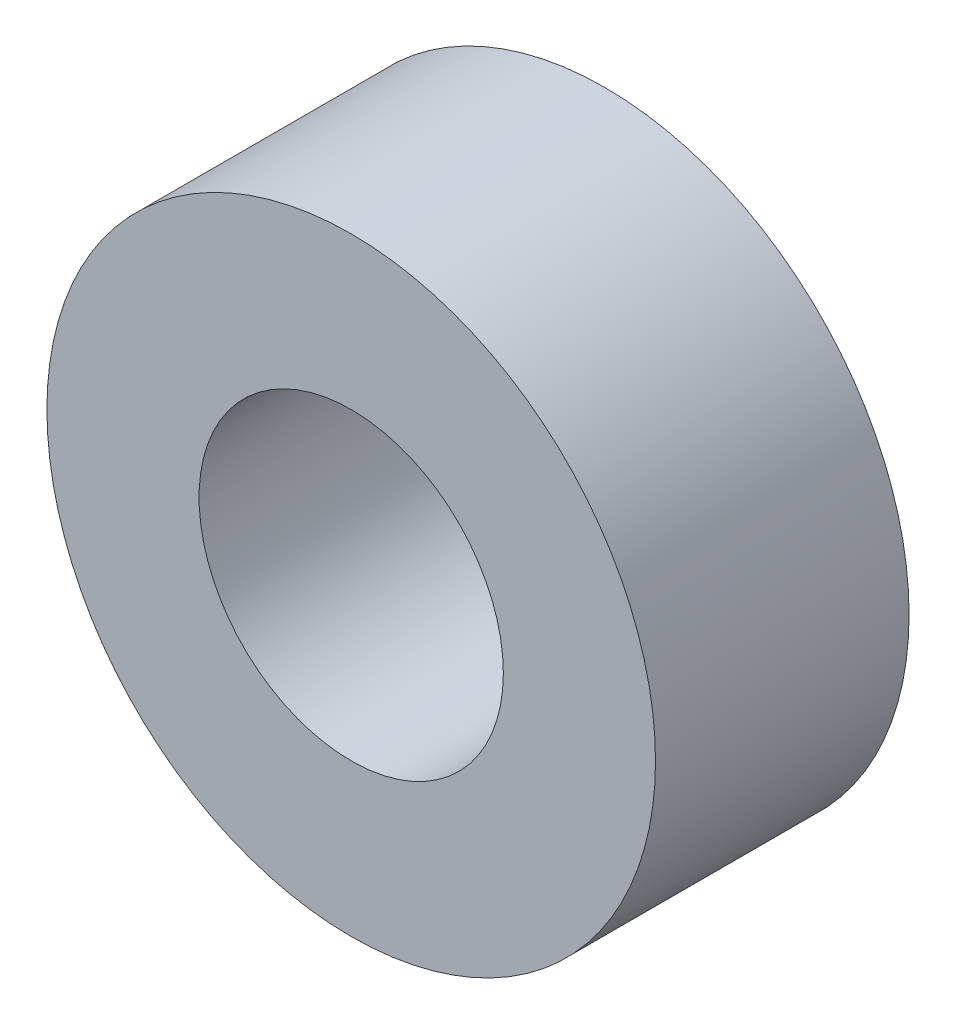
ISO-10303-21;
HEADER;
FILE_DESCRIPTION(('STEP AP214'),'2;1');
FILE_NAME('part.step','',(''),(''),'','','');
FILE_SCHEMA(('AUTOMOTIVE_DESIGN { 1 0 10303 214 1 1 1 1 }'));
ENDSEC;
DATA;
#1=APPLICATION_CONTEXT('core data for automotive mechanical design processes');
#2=APPLICATION_PROTOCOL_DEFINITION('international standard','automotive_design',2000,#1);
#3=PRODUCT_CONTEXT('',#1,'mechanical');
#4=PRODUCT('Part','Part','',(#3));
#5=PRODUCT_RELATED_PRODUCT_CATEGORY('part','',(#4));
#6=PRODUCT_DEFINITION_FORMATION('','',#4);
#7=PRODUCT_DEFINITION_CONTEXT('part definition',#1,'design');
#8=PRODUCT_DEFINITION('design','',#6,#7);
#9=PRODUCT_DEFINITION_SHAPE('','',#8);
#10=(LENGTH_UNIT() NAMED_UNIT(*) SI_UNIT(.MILLI.,.METRE.));
#11=(NAMED_UNIT(*) PLANE_ANGLE_UNIT() SI_UNIT($,.RADIAN.));
#12=(NAMED_UNIT(*) SI_UNIT($,.STERADIAN.) SOLID_ANGLE_UNIT());
#13=UNCERTAINTY_MEASURE_WITH_UNIT(LENGTH_MEASURE(1.E-05),#10,'distance_accuracy_value','');
#14=(GEOMETRIC_REPRESENTATION_CONTEXT(3) GLOBAL_UNCERTAINTY_ASSIGNED_CONTEXT((#13)) GLOBAL_UNIT_ASSIGNED_CONTEXT((#10,
#11,#12)) REPRESENTATION_CONTEXT('',''));
#15=CARTESIAN_POINT('',(0.,0.,0.));
#16=DIRECTION('',(0.,0.,1.));
#17=DIRECTION('',(1.,0.,0.));
#18=AXIS2_PLACEMENT_3D('',#15,#16,#17);
#19=CARTESIAN_POINT('',(0.,0.,2.5));
#20=DIRECTION('',(0.,0.,1.));
#21=DIRECTION('',(1.,0.,0.));
#22=AXIS2_PLACEMENT_3D('',#19,#20,#21);
#23=PLANE('',#22);
#24=CARTESIAN_POINT('',(0.,0.,2.5));
#25=DIRECTION('',(0.,0.,1.));
#26=DIRECTION('',(1.,0.,0.));
#27=AXIS2_PLACEMENT_3D('',#24,#25,#26);
#28=CIRCLE('',#27,3.);
#29=CARTESIAN_POINT('',(3.,0.,2.5));
#30=VERTEX_POINT('',#29);
#31=EDGE_CURVE('E10',#30,#30,#28,.T.);
#32=ORIENTED_EDGE('',*,*,#31,.T.);
#33=EDGE_LOOP('',(#32));
#34=FACE_BOUND('',#33,.T.);
#35=CARTESIAN_POINT('',(0.,0.,2.5));
#36=DIRECTION('',(0.,0.,1.));
#37=DIRECTION('',(1.,0.,0.));
#38=AXIS2_PLACEMENT_3D('',#35,#36,#37);
#39=CIRCLE('',#38,1.5);
#40=CARTESIAN_POINT('',(1.5,0.,2.5));
#41=VERTEX_POINT('',#40);
#42=EDGE_CURVE('E50',#41,#41,#39,.T.);
#43=ORIENTED_EDGE('',*,*,#42,.F.);
#44=EDGE_LOOP('',(#43));
#45=FACE_BOUND('',#44,.T.);
#46=ADVANCED_FACE('F37',(#34,#45),#23,.T.);
#47=CARTESIAN_POINT('',(0.,0.,0.));
#48=DIRECTION('',(0.,0.,1.));
#49=DIRECTION('',(1.,0.,0.));
#50=AXIS2_PLACEMENT_3D('',#47,#48,#49);
#51=PLANE('',#50);
#52=CARTESIAN_POINT('',(0.,0.,0.));
#53=DIRECTION('',(0.,0.,1.));
#54=DIRECTION('',(1.,0.,0.));
#55=AXIS2_PLACEMENT_3D('',#52,#53,#54);
#56=CIRCLE('',#55,3.);
#57=CARTESIAN_POINT('',(3.,0.,0.));
#58=VERTEX_POINT('',#57);
#59=EDGE_CURVE('E41',#58,#58,#56,.T.);
#60=ORIENTED_EDGE('',*,*,#59,.F.);
#61=EDGE_LOOP('',(#60));
#62=FACE_BOUND('',#61,.T.);
#63=CARTESIAN_POINT('',(0.,0.,0.));
#64=DIRECTION('',(0.,0.,1.));
#65=DIRECTION('',(1.,0.,0.));
#66=AXIS2_PLACEMENT_3D('',#63,#64,#65);
#67=CIRCLE('',#66,1.5);
#68=CARTESIAN_POINT('',(1.5,0.,0.));
#69=VERTEX_POINT('',#68);
#70=EDGE_CURVE('E52',#69,#69,#67,.T.);
#71=ORIENTED_EDGE('',*,*,#70,.T.);
#72=EDGE_LOOP('',(#71));
#73=FACE_BOUND('',#72,.T.);
#74=ADVANCED_FACE('F64',(#62,#73),#51,.F.);
#75=CARTESIAN_POINT('',(0.,0.,2.5));
#76=DIRECTION('',(0.,0.,-1.));
#77=DIRECTION('',(-1.,0.,0.));
#78=AXIS2_PLACEMENT_3D('',#75,#76,#77);
#79=CYLINDRICAL_SURFACE('',#78,3.);
#80=ORIENTED_EDGE('',*,*,#31,.F.);
#81=EDGE_LOOP('',(#80));
#82=FACE_BOUND('',#81,.T.);
#83=ORIENTED_EDGE('',*,*,#59,.T.);
#84=EDGE_LOOP('',(#83));
#85=FACE_BOUND('',#84,.T.);
#86=ADVANCED_FACE('F39',(#82,#85),#79,.T.);
#87=CARTESIAN_POINT('',(0.,0.,2.5));
#88=DIRECTION('',(0.,0.,-1.));
#89=DIRECTION('',(-1.,0.,0.));
#90=AXIS2_PLACEMENT_3D('',#87,#88,#89);
#91=CYLINDRICAL_SURFACE('',#90,1.5);
#92=ORIENTED_EDGE('',*,*,#42,.T.);
#93=EDGE_LOOP('',(#92));
#94=FACE_BOUND('',#93,.T.);
#95=ORIENTED_EDGE('',*,*,#70,.F.);
#96=EDGE_LOOP('',(#95));
#97=FACE_BOUND('',#96,.T.);
#98=ADVANCED_FACE('F60',(#94,#97),#91,.F.);
#99=CLOSED_SHELL('',(#46,#74,#86,#98));
#100=MANIFOLD_SOLID_BREP('B2',#99);
#101=ADVANCED_BREP_SHAPE_REPRESENTATION('',(#18,#100),#14);
#102=SHAPE_DEFINITION_REPRESENTATION(#9,#101);
ENDSEC;
END-ISO-10303-21;
